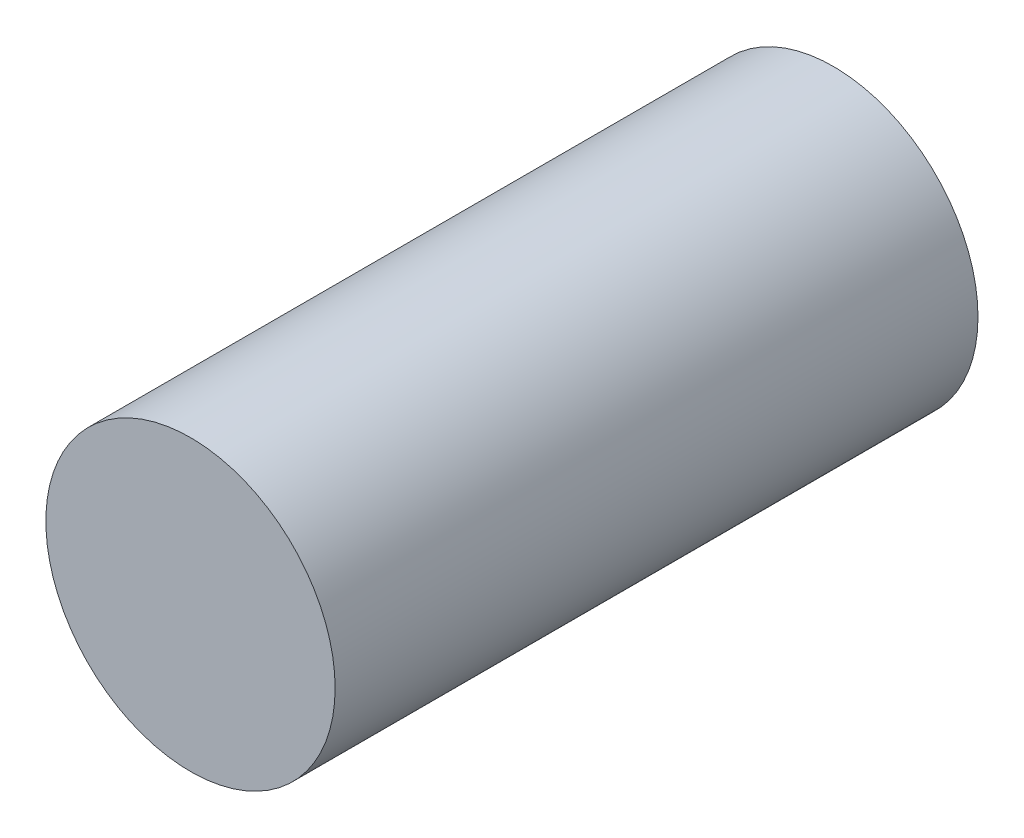
ISO-10303-21;
HEADER;
FILE_DESCRIPTION(('STEP AP214'),'2;1');
FILE_NAME('part.step','',(''),(''),'','','');
FILE_SCHEMA(('AUTOMOTIVE_DESIGN { 1 0 10303 214 1 1 1 1 }'));
ENDSEC;
DATA;
#1=APPLICATION_CONTEXT('core data for automotive mechanical design processes');
#2=APPLICATION_PROTOCOL_DEFINITION('international standard','automotive_design',2000,#1);
#3=PRODUCT_CONTEXT('',#1,'mechanical');
#4=PRODUCT('Part','Part','',(#3));
#5=PRODUCT_RELATED_PRODUCT_CATEGORY('part','',(#4));
#6=PRODUCT_DEFINITION_FORMATION('','',#4);
#7=PRODUCT_DEFINITION_CONTEXT('part definition',#1,'design');
#8=PRODUCT_DEFINITION('design','',#6,#7);
#9=PRODUCT_DEFINITION_SHAPE('','',#8);
#10=(LENGTH_UNIT() NAMED_UNIT(*) SI_UNIT(.MILLI.,.METRE.));
#11=(NAMED_UNIT(*) PLANE_ANGLE_UNIT() SI_UNIT($,.RADIAN.));
#12=(NAMED_UNIT(*) SI_UNIT($,.STERADIAN.) SOLID_ANGLE_UNIT());
#13=UNCERTAINTY_MEASURE_WITH_UNIT(LENGTH_MEASURE(1.E-05),#10,'distance_accuracy_value','');
#14=(GEOMETRIC_REPRESENTATION_CONTEXT(3) GLOBAL_UNCERTAINTY_ASSIGNED_CONTEXT((#13)) GLOBAL_UNIT_ASSIGNED_CONTEXT((#10,
#11,#12)) REPRESENTATION_CONTEXT('',''));
#15=CARTESIAN_POINT('',(0.,0.,0.));
#16=DIRECTION('',(0.,0.,1.));
#17=DIRECTION('',(1.,0.,0.));
#18=AXIS2_PLACEMENT_3D('',#15,#16,#17);
#19=CARTESIAN_POINT('',(0.,0.,20.));
#20=DIRECTION('',(0.,0.,-1.));
#21=DIRECTION('',(-1.,0.,0.));
#22=AXIS2_PLACEMENT_3D('',#19,#20,#21);
#23=CYLINDRICAL_SURFACE('',#22,4.5);
#24=CARTESIAN_POINT('',(0.,0.,20.));
#25=DIRECTION('',(0.,0.,1.));
#26=DIRECTION('',(1.,0.,0.));
#27=AXIS2_PLACEMENT_3D('',#24,#25,#26);
#28=CIRCLE('',#27,4.5);
#29=CARTESIAN_POINT('',(4.5,0.,20.));
#30=VERTEX_POINT('',#29);
#31=EDGE_CURVE('E10',#30,#30,#28,.T.);
#32=ORIENTED_EDGE('',*,*,#31,.F.);
#33=EDGE_LOOP('',(#32));
#34=FACE_BOUND('',#33,.T.);
#35=CARTESIAN_POINT('',(0.,0.,0.));
#36=DIRECTION('',(0.,0.,1.));
#37=DIRECTION('',(1.,0.,0.));
#38=AXIS2_PLACEMENT_3D('',#35,#36,#37);
#39=CIRCLE('',#38,4.5);
#40=CARTESIAN_POINT('',(4.5,0.,0.));
#41=VERTEX_POINT('',#40);
#42=EDGE_CURVE('E40',#41,#41,#39,.T.);
#43=ORIENTED_EDGE('',*,*,#42,.T.);
#44=EDGE_LOOP('',(#43));
#45=FACE_BOUND('',#44,.T.);
#46=ADVANCED_FACE('F37',(#34,#45),#23,.T.);
#47=CARTESIAN_POINT('',(0.,0.,20.));
#48=DIRECTION('',(0.,0.,1.));
#49=DIRECTION('',(1.,0.,0.));
#50=AXIS2_PLACEMENT_3D('',#47,#48,#49);
#51=PLANE('',#50);
#52=ORIENTED_EDGE('',*,*,#31,.T.);
#53=EDGE_LOOP('',(#52));
#54=FACE_BOUND('',#53,.T.);
#55=ADVANCED_FACE('F71',(#54),#51,.T.);
#56=CARTESIAN_POINT('',(0.,0.,0.));
#57=DIRECTION('',(0.,0.,1.));
#58=DIRECTION('',(1.,0.,0.));
#59=AXIS2_PLACEMENT_3D('',#56,#57,#58);
#60=PLANE('',#59);
#61=CARTESIAN_POINT('',(0.,0.,0.));
#62=DIRECTION('',(0.,0.,1.));
#63=DIRECTION('',(1.,0.,0.));
#64=AXIS2_PLACEMENT_3D('',#61,#62,#63);
#65=CIRCLE('',#64,1.);
#66=CARTESIAN_POINT('',(1.,0.,0.));
#67=VERTEX_POINT('',#66);
#68=EDGE_CURVE('E51',#67,#67,#65,.T.);
#69=ORIENTED_EDGE('',*,*,#68,.T.);
#70=EDGE_LOOP('',(#69));
#71=FACE_BOUND('',#70,.T.);
#72=ORIENTED_EDGE('',*,*,#42,.F.);
#73=EDGE_LOOP('',(#72));
#74=FACE_BOUND('',#73,.T.);
#75=ADVANCED_FACE('F68',(#71,#74),#60,.F.);
#76=CARTESIAN_POINT('',(0.,0.,15.));
#77=DIRECTION('',(0.,0.,-1.));
#78=DIRECTION('',(-1.,0.,0.));
#79=AXIS2_PLACEMENT_3D('',#76,#77,#78);
#80=CYLINDRICAL_SURFACE('',#79,1.);
#81=CARTESIAN_POINT('',(0.,0.,15.));
#82=DIRECTION('',(0.,0.,1.));
#83=DIRECTION('',(1.,0.,0.));
#84=AXIS2_PLACEMENT_3D('',#81,#82,#83);
#85=CIRCLE('',#84,1.);
#86=CARTESIAN_POINT('',(1.,0.,15.));
#87=VERTEX_POINT('',#86);
#88=EDGE_CURVE('E49',#87,#87,#85,.T.);
#89=ORIENTED_EDGE('',*,*,#88,.T.);
#90=EDGE_LOOP('',(#89));
#91=FACE_BOUND('',#90,.T.);
#92=ORIENTED_EDGE('',*,*,#68,.F.);
#93=EDGE_LOOP('',(#92));
#94=FACE_BOUND('',#93,.T.);
#95=ADVANCED_FACE('F59',(#91,#94),#80,.F.);
#96=CARTESIAN_POINT('',(0.,0.,15.));
#97=DIRECTION('',(0.,0.,1.));
#98=DIRECTION('',(1.,0.,0.));
#99=AXIS2_PLACEMENT_3D('',#96,#97,#98);
#100=PLANE('',#99);
#101=ORIENTED_EDGE('',*,*,#88,.F.);
#102=EDGE_LOOP('',(#101));
#103=FACE_BOUND('',#102,.T.);
#104=ADVANCED_FACE('F62',(#103),#100,.F.);
#105=CLOSED_SHELL('',(#46,#55,#75,#95,#104));
#106=MANIFOLD_SOLID_BREP('B2',#105);
#107=ADVANCED_BREP_SHAPE_REPRESENTATION('',(#18,#106),#14);
#108=SHAPE_DEFINITION_REPRESENTATION(#9,#107);
ENDSEC;
END-ISO-10303-21;
